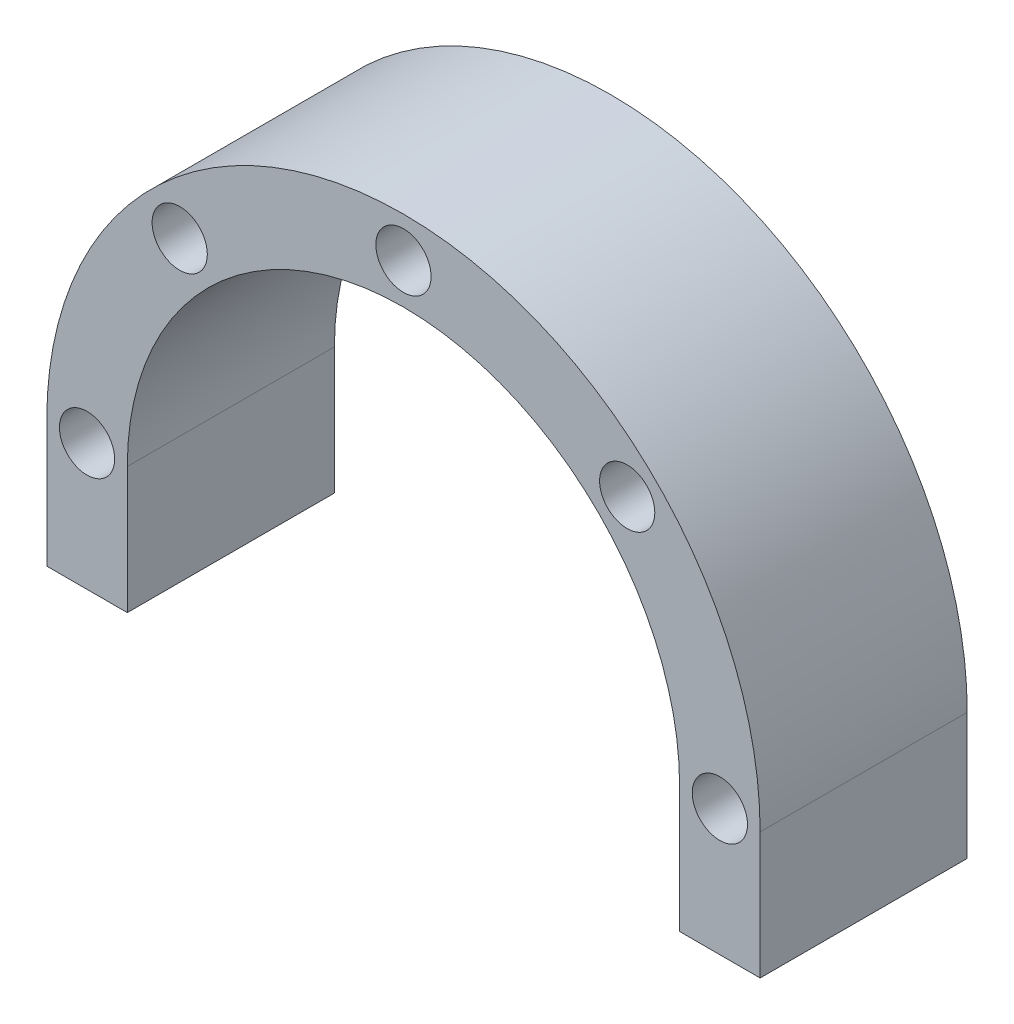
ISO-10303-21;
HEADER;
FILE_DESCRIPTION(('STEP AP214'),'2;1');
FILE_NAME('part.step','',(''),(''),'','','');
FILE_SCHEMA(('AUTOMOTIVE_DESIGN { 1 0 10303 214 1 1 1 1 }'));
ENDSEC;
DATA;
#1=APPLICATION_CONTEXT('core data for automotive mechanical design processes');
#2=APPLICATION_PROTOCOL_DEFINITION('international standard','automotive_design',2000,#1);
#3=PRODUCT_CONTEXT('',#1,'mechanical');
#4=PRODUCT('Part','Part','',(#3));
#5=PRODUCT_RELATED_PRODUCT_CATEGORY('part','',(#4));
#6=PRODUCT_DEFINITION_FORMATION('','',#4);
#7=PRODUCT_DEFINITION_CONTEXT('part definition',#1,'design');
#8=PRODUCT_DEFINITION('design','',#6,#7);
#9=PRODUCT_DEFINITION_SHAPE('','',#8);
#10=(LENGTH_UNIT() NAMED_UNIT(*) SI_UNIT(.MILLI.,.METRE.));
#11=(NAMED_UNIT(*) PLANE_ANGLE_UNIT() SI_UNIT($,.RADIAN.));
#12=(NAMED_UNIT(*) SI_UNIT($,.STERADIAN.) SOLID_ANGLE_UNIT());
#13=UNCERTAINTY_MEASURE_WITH_UNIT(LENGTH_MEASURE(1.E-05),#10,'distance_accuracy_value','');
#14=(GEOMETRIC_REPRESENTATION_CONTEXT(3) GLOBAL_UNCERTAINTY_ASSIGNED_CONTEXT((#13)) GLOBAL_UNIT_ASSIGNED_CONTEXT((#10,
#11,#12)) REPRESENTATION_CONTEXT('',''));
#15=CARTESIAN_POINT('',(0.,0.,0.));
#16=DIRECTION('',(0.,0.,1.));
#17=DIRECTION('',(1.,0.,0.));
#18=AXIS2_PLACEMENT_3D('',#15,#16,#17);
#19=CARTESIAN_POINT('',(0.,-11.,18.));
#20=DIRECTION('',(0.,1.,0.));
#21=DIRECTION('',(0.,0.,1.));
#22=AXIS2_PLACEMENT_3D('',#19,#20,#21);
#23=PLANE('',#22);
#24=DIRECTION('',(1.,0.,0.));
#25=VECTOR('',#24,1.);
#26=CARTESIAN_POINT('',(0.,-11.,0.));
#27=LINE('',#26,#25);
#28=CARTESIAN_POINT('',(-31.,-11.,0.));
#29=VERTEX_POINT('',#28);
#30=CARTESIAN_POINT('',(-24.,-11.,0.));
#31=VERTEX_POINT('',#30);
#32=EDGE_CURVE('E129',#29,#31,#27,.T.);
#33=ORIENTED_EDGE('',*,*,#32,.T.);
#34=DIRECTION('',(0.,0.,1.));
#35=VECTOR('',#34,1.);
#36=CARTESIAN_POINT('',(-24.,-11.,0.));
#37=LINE('',#36,#35);
#38=CARTESIAN_POINT('',(-24.,-11.,18.));
#39=VERTEX_POINT('',#38);
#40=EDGE_CURVE('E164',#31,#39,#37,.T.);
#41=ORIENTED_EDGE('',*,*,#40,.T.);
#42=DIRECTION('',(1.,0.,0.));
#43=VECTOR('',#42,1.);
#44=CARTESIAN_POINT('',(0.,-11.,18.));
#45=LINE('',#44,#43);
#46=CARTESIAN_POINT('',(-31.,-11.,18.));
#47=VERTEX_POINT('',#46);
#48=EDGE_CURVE('E148',#47,#39,#45,.T.);
#49=ORIENTED_EDGE('',*,*,#48,.F.);
#50=DIRECTION('',(0.,0.,-1.));
#51=VECTOR('',#50,1.);
#52=CARTESIAN_POINT('',(-31.,-11.,18.));
#53=LINE('',#52,#51);
#54=EDGE_CURVE('E43',#47,#29,#53,.T.);
#55=ORIENTED_EDGE('',*,*,#54,.T.);
#56=EDGE_LOOP('',(#33,#41,#49,#55));
#57=FACE_BOUND('',#56,.T.);
#58=ADVANCED_FACE('F35',(#57),#23,.F.);
#59=CARTESIAN_POINT('',(0.,0.,18.));
#60=DIRECTION('',(0.,0.,-1.));
#61=DIRECTION('',(-1.,0.,0.));
#62=AXIS2_PLACEMENT_3D('',#59,#60,#61);
#63=CYLINDRICAL_SURFACE('',#62,31.);
#64=CARTESIAN_POINT('',(0.,0.,0.));
#65=DIRECTION('',(0.,0.,1.));
#66=DIRECTION('',(1.,0.,0.));
#67=AXIS2_PLACEMENT_3D('',#64,#65,#66);
#68=CIRCLE('',#67,31.);
#69=CARTESIAN_POINT('',(-31.,0.,0.));
#70=VERTEX_POINT('',#69);
#71=CARTESIAN_POINT('',(31.,0.,0.));
#72=VERTEX_POINT('',#71);
#73=EDGE_CURVE('E133',#70,#72,#68,.F.);
#74=ORIENTED_EDGE('',*,*,#73,.F.);
#75=DIRECTION('',(0.,0.,-1.));
#76=VECTOR('',#75,1.);
#77=CARTESIAN_POINT('',(-31.,0.,18.));
#78=LINE('',#77,#76);
#79=CARTESIAN_POINT('',(-31.,0.,18.));
#80=VERTEX_POINT('',#79);
#81=EDGE_CURVE('E11',#80,#70,#78,.T.);
#82=ORIENTED_EDGE('',*,*,#81,.F.);
#83=CARTESIAN_POINT('',(0.,0.,18.));
#84=DIRECTION('',(0.,0.,1.));
#85=DIRECTION('',(1.,0.,0.));
#86=AXIS2_PLACEMENT_3D('',#83,#84,#85);
#87=CIRCLE('',#86,31.);
#88=CARTESIAN_POINT('',(31.,0.,18.));
#89=VERTEX_POINT('',#88);
#90=EDGE_CURVE('E138',#80,#89,#87,.F.);
#91=ORIENTED_EDGE('',*,*,#90,.T.);
#92=DIRECTION('',(0.,0.,-1.));
#93=VECTOR('',#92,1.);
#94=CARTESIAN_POINT('',(31.,0.,18.));
#95=LINE('',#94,#93);
#96=EDGE_CURVE('E79',#89,#72,#95,.T.);
#97=ORIENTED_EDGE('',*,*,#96,.T.);
#98=EDGE_LOOP('',(#74,#82,#91,#97));
#99=FACE_BOUND('',#98,.T.);
#100=ADVANCED_FACE('F37',(#99),#63,.T.);
#101=CARTESIAN_POINT('',(-31.,0.,18.));
#102=DIRECTION('',(1.,0.,0.));
#103=DIRECTION('',(0.,0.,-1.));
#104=AXIS2_PLACEMENT_3D('',#101,#102,#103);
#105=PLANE('',#104);
#106=DIRECTION('',(0.,-1.,0.));
#107=VECTOR('',#106,1.);
#108=CARTESIAN_POINT('',(-31.,0.,0.));
#109=LINE('',#108,#107);
#110=EDGE_CURVE('E130',#70,#29,#109,.T.);
#111=ORIENTED_EDGE('',*,*,#110,.T.);
#112=ORIENTED_EDGE('',*,*,#54,.F.);
#113=DIRECTION('',(0.,-1.,0.));
#114=VECTOR('',#113,1.);
#115=CARTESIAN_POINT('',(-31.,0.,18.));
#116=LINE('',#115,#114);
#117=EDGE_CURVE('E170',#80,#47,#116,.T.);
#118=ORIENTED_EDGE('',*,*,#117,.F.);
#119=ORIENTED_EDGE('',*,*,#81,.T.);
#120=EDGE_LOOP('',(#111,#112,#118,#119));
#121=FACE_BOUND('',#120,.T.);
#122=ADVANCED_FACE('F174',(#121),#105,.F.);
#123=CARTESIAN_POINT('',(24.,-11.,18.));
#124=VERTEX_POINT('',#123);
#125=CARTESIAN_POINT('',(31.,-11.,18.));
#126=VERTEX_POINT('',#125);
#127=EDGE_CURVE('E122',#124,#126,#45,.T.);
#128=ORIENTED_EDGE('',*,*,#127,.F.);
#129=DIRECTION('',(0.,0.,1.));
#130=VECTOR('',#129,1.);
#131=CARTESIAN_POINT('',(24.,-11.,0.));
#132=LINE('',#131,#130);
#133=CARTESIAN_POINT('',(24.,-11.,0.));
#134=VERTEX_POINT('',#133);
#135=EDGE_CURVE('E109',#134,#124,#132,.T.);
#136=ORIENTED_EDGE('',*,*,#135,.F.);
#137=CARTESIAN_POINT('',(31.,-11.,0.));
#138=VERTEX_POINT('',#137);
#139=EDGE_CURVE('E120',#134,#138,#27,.T.);
#140=ORIENTED_EDGE('',*,*,#139,.T.);
#141=DIRECTION('',(0.,0.,-1.));
#142=VECTOR('',#141,1.);
#143=CARTESIAN_POINT('',(31.,-11.,18.));
#144=LINE('',#143,#142);
#145=EDGE_CURVE('E140',#126,#138,#144,.T.);
#146=ORIENTED_EDGE('',*,*,#145,.F.);
#147=EDGE_LOOP('',(#128,#136,#140,#146));
#148=FACE_BOUND('',#147,.T.);
#149=ADVANCED_FACE('F118',(#148),#23,.F.);
#150=CARTESIAN_POINT('',(31.,0.,18.));
#151=DIRECTION('',(-1.,0.,0.));
#152=DIRECTION('',(0.,-1.,0.));
#153=AXIS2_PLACEMENT_3D('',#150,#151,#152);
#154=PLANE('',#153);
#155=DIRECTION('',(0.,1.,0.));
#156=VECTOR('',#155,1.);
#157=CARTESIAN_POINT('',(31.,0.,0.));
#158=LINE('',#157,#156);
#159=EDGE_CURVE('E128',#138,#72,#158,.T.);
#160=ORIENTED_EDGE('',*,*,#159,.T.);
#161=ORIENTED_EDGE('',*,*,#96,.F.);
#162=DIRECTION('',(0.,1.,0.));
#163=VECTOR('',#162,1.);
#164=CARTESIAN_POINT('',(31.,0.,18.));
#165=LINE('',#164,#163);
#166=EDGE_CURVE('E59',#126,#89,#165,.T.);
#167=ORIENTED_EDGE('',*,*,#166,.F.);
#168=ORIENTED_EDGE('',*,*,#145,.T.);
#169=EDGE_LOOP('',(#160,#161,#167,#168));
#170=FACE_BOUND('',#169,.T.);
#171=ADVANCED_FACE('F184',(#170),#154,.F.);
#172=CARTESIAN_POINT('',(0.,0.,18.));
#173=DIRECTION('',(0.,0.,1.));
#174=DIRECTION('',(1.,0.,0.));
#175=AXIS2_PLACEMENT_3D('',#172,#173,#174);
#176=PLANE('',#175);
#177=CARTESIAN_POINT('',(-19.4454364826298,19.4454364826303,18.));
#178=DIRECTION('',(0.,0.,1.));
#179=DIRECTION('',(1.,0.,0.));
#180=AXIS2_PLACEMENT_3D('',#177,#178,#179);
#181=CIRCLE('',#180,2.4);
#182=CARTESIAN_POINT('',(-17.0454364826298,19.4454364826303,18.));
#183=VERTEX_POINT('',#182);
#184=EDGE_CURVE('E234',#183,#183,#181,.T.);
#185=ORIENTED_EDGE('',*,*,#184,.F.);
#186=EDGE_LOOP('',(#185));
#187=FACE_BOUND('',#186,.T.);
#188=CARTESIAN_POINT('',(-27.5,2.88047210454558E-13,18.));
#189=DIRECTION('',(0.,0.,1.));
#190=DIRECTION('',(1.,0.,0.));
#191=AXIS2_PLACEMENT_3D('',#188,#189,#190);
#192=CIRCLE('',#191,2.4);
#193=CARTESIAN_POINT('',(-25.1,2.88047210454558E-13,18.));
#194=VERTEX_POINT('',#193);
#195=EDGE_CURVE('E236',#194,#194,#192,.T.);
#196=ORIENTED_EDGE('',*,*,#195,.F.);
#197=EDGE_LOOP('',(#196));
#198=FACE_BOUND('',#197,.T.);
#199=CARTESIAN_POINT('',(27.5,0.,18.));
#200=DIRECTION('',(0.,0.,1.));
#201=DIRECTION('',(1.,0.,0.));
#202=AXIS2_PLACEMENT_3D('',#199,#200,#201);
#203=CIRCLE('',#202,2.4);
#204=CARTESIAN_POINT('',(29.9,0.,18.));
#205=VERTEX_POINT('',#204);
#206=EDGE_CURVE('E244',#205,#205,#203,.T.);
#207=ORIENTED_EDGE('',*,*,#206,.F.);
#208=EDGE_LOOP('',(#207));
#209=FACE_BOUND('',#208,.T.);
#210=CARTESIAN_POINT('',(19.4454364826301,19.44543648263,18.));
#211=DIRECTION('',(0.,0.,1.));
#212=DIRECTION('',(1.,0.,0.));
#213=AXIS2_PLACEMENT_3D('',#210,#211,#212);
#214=CIRCLE('',#213,2.4);
#215=CARTESIAN_POINT('',(21.8454364826301,19.44543648263,18.));
#216=VERTEX_POINT('',#215);
#217=EDGE_CURVE('E250',#216,#216,#214,.T.);
#218=ORIENTED_EDGE('',*,*,#217,.F.);
#219=EDGE_LOOP('',(#218));
#220=FACE_BOUND('',#219,.T.);
#221=CARTESIAN_POINT('',(0.,27.5,18.));
#222=DIRECTION('',(0.,0.,1.));
#223=DIRECTION('',(1.,0.,0.));
#224=AXIS2_PLACEMENT_3D('',#221,#222,#223);
#225=CIRCLE('',#224,2.4);
#226=CARTESIAN_POINT('',(2.4,27.5,18.));
#227=VERTEX_POINT('',#226);
#228=EDGE_CURVE('E256',#227,#227,#225,.T.);
#229=ORIENTED_EDGE('',*,*,#228,.F.);
#230=EDGE_LOOP('',(#229));
#231=FACE_BOUND('',#230,.T.);
#232=DIRECTION('',(0.,-1.,0.));
#233=VECTOR('',#232,1.);
#234=CARTESIAN_POINT('',(-24.,0.,18.));
#235=LINE('',#234,#233);
#236=CARTESIAN_POINT('',(-24.,0.,18.));
#237=VERTEX_POINT('',#236);
#238=EDGE_CURVE('E114',#237,#39,#235,.T.);
#239=ORIENTED_EDGE('',*,*,#238,.F.);
#240=CARTESIAN_POINT('',(0.,0.,18.));
#241=DIRECTION('',(0.,0.,1.));
#242=DIRECTION('',(1.,0.,0.));
#243=AXIS2_PLACEMENT_3D('',#240,#241,#242);
#244=CIRCLE('',#243,24.);
#245=CARTESIAN_POINT('',(24.,0.,18.));
#246=VERTEX_POINT('',#245);
#247=EDGE_CURVE('E159',#246,#237,#244,.T.);
#248=ORIENTED_EDGE('',*,*,#247,.F.);
#249=DIRECTION('',(0.,1.,0.));
#250=VECTOR('',#249,1.);
#251=CARTESIAN_POINT('',(24.,-11.,18.));
#252=LINE('',#251,#250);
#253=EDGE_CURVE('E157',#124,#246,#252,.T.);
#254=ORIENTED_EDGE('',*,*,#253,.F.);
#255=ORIENTED_EDGE('',*,*,#127,.T.);
#256=ORIENTED_EDGE('',*,*,#166,.T.);
#257=ORIENTED_EDGE('',*,*,#90,.F.);
#258=ORIENTED_EDGE('',*,*,#117,.T.);
#259=ORIENTED_EDGE('',*,*,#48,.T.);
#260=EDGE_LOOP('',(#239,#248,#254,#255,#256,#257,#258,#259));
#261=FACE_BOUND('',#260,.T.);
#262=ADVANCED_FACE('F188',(#187,#198,#209,#220,#231,#261),#176,.T.);
#263=CARTESIAN_POINT('',(0.,0.,0.));
#264=DIRECTION('',(0.,0.,1.));
#265=DIRECTION('',(1.,0.,0.));
#266=AXIS2_PLACEMENT_3D('',#263,#264,#265);
#267=PLANE('',#266);
#268=CARTESIAN_POINT('',(-19.4454364826298,19.4454364826303,0.));
#269=DIRECTION('',(0.,0.,1.));
#270=DIRECTION('',(1.,0.,0.));
#271=AXIS2_PLACEMENT_3D('',#268,#269,#270);
#272=CIRCLE('',#271,2.4);
#273=CARTESIAN_POINT('',(-17.0454364826298,19.4454364826303,0.));
#274=VERTEX_POINT('',#273);
#275=EDGE_CURVE('E231',#274,#274,#272,.T.);
#276=ORIENTED_EDGE('',*,*,#275,.T.);
#277=EDGE_LOOP('',(#276));
#278=FACE_BOUND('',#277,.T.);
#279=CARTESIAN_POINT('',(-27.5,2.88047210454558E-13,0.));
#280=DIRECTION('',(0.,0.,1.));
#281=DIRECTION('',(1.,0.,0.));
#282=AXIS2_PLACEMENT_3D('',#279,#280,#281);
#283=CIRCLE('',#282,2.4);
#284=CARTESIAN_POINT('',(-25.1,2.88047210454558E-13,0.));
#285=VERTEX_POINT('',#284);
#286=EDGE_CURVE('E241',#285,#285,#283,.T.);
#287=ORIENTED_EDGE('',*,*,#286,.T.);
#288=EDGE_LOOP('',(#287));
#289=FACE_BOUND('',#288,.T.);
#290=CARTESIAN_POINT('',(27.5,0.,0.));
#291=DIRECTION('',(0.,0.,1.));
#292=DIRECTION('',(1.,0.,0.));
#293=AXIS2_PLACEMENT_3D('',#290,#291,#292);
#294=CIRCLE('',#293,2.4);
#295=CARTESIAN_POINT('',(29.9,0.,0.));
#296=VERTEX_POINT('',#295);
#297=EDGE_CURVE('E247',#296,#296,#294,.T.);
#298=ORIENTED_EDGE('',*,*,#297,.T.);
#299=EDGE_LOOP('',(#298));
#300=FACE_BOUND('',#299,.T.);
#301=CARTESIAN_POINT('',(19.4454364826301,19.44543648263,0.));
#302=DIRECTION('',(0.,0.,1.));
#303=DIRECTION('',(1.,0.,0.));
#304=AXIS2_PLACEMENT_3D('',#301,#302,#303);
#305=CIRCLE('',#304,2.4);
#306=CARTESIAN_POINT('',(21.8454364826301,19.44543648263,0.));
#307=VERTEX_POINT('',#306);
#308=EDGE_CURVE('E253',#307,#307,#305,.T.);
#309=ORIENTED_EDGE('',*,*,#308,.T.);
#310=EDGE_LOOP('',(#309));
#311=FACE_BOUND('',#310,.T.);
#312=CARTESIAN_POINT('',(0.,27.5,0.));
#313=DIRECTION('',(0.,0.,1.));
#314=DIRECTION('',(1.,0.,0.));
#315=AXIS2_PLACEMENT_3D('',#312,#313,#314);
#316=CIRCLE('',#315,2.4);
#317=CARTESIAN_POINT('',(2.4,27.5,0.));
#318=VERTEX_POINT('',#317);
#319=EDGE_CURVE('E160',#318,#318,#316,.T.);
#320=ORIENTED_EDGE('',*,*,#319,.T.);
#321=EDGE_LOOP('',(#320));
#322=FACE_BOUND('',#321,.T.);
#323=CARTESIAN_POINT('',(0.,0.,0.));
#324=DIRECTION('',(0.,0.,1.));
#325=DIRECTION('',(1.,0.,0.));
#326=AXIS2_PLACEMENT_3D('',#323,#324,#325);
#327=CIRCLE('',#326,24.);
#328=CARTESIAN_POINT('',(24.,0.,0.));
#329=VERTEX_POINT('',#328);
#330=CARTESIAN_POINT('',(-24.,0.,0.));
#331=VERTEX_POINT('',#330);
#332=EDGE_CURVE('E50',#329,#331,#327,.T.);
#333=ORIENTED_EDGE('',*,*,#332,.T.);
#334=DIRECTION('',(0.,-1.,0.));
#335=VECTOR('',#334,1.);
#336=CARTESIAN_POINT('',(-24.,0.,0.));
#337=LINE('',#336,#335);
#338=EDGE_CURVE('E123',#331,#31,#337,.T.);
#339=ORIENTED_EDGE('',*,*,#338,.T.);
#340=ORIENTED_EDGE('',*,*,#32,.F.);
#341=ORIENTED_EDGE('',*,*,#110,.F.);
#342=ORIENTED_EDGE('',*,*,#73,.T.);
#343=ORIENTED_EDGE('',*,*,#159,.F.);
#344=ORIENTED_EDGE('',*,*,#139,.F.);
#345=DIRECTION('',(0.,1.,0.));
#346=VECTOR('',#345,1.);
#347=CARTESIAN_POINT('',(24.,-11.,0.));
#348=LINE('',#347,#346);
#349=EDGE_CURVE('E105',#134,#329,#348,.T.);
#350=ORIENTED_EDGE('',*,*,#349,.T.);
#351=EDGE_LOOP('',(#333,#339,#340,#341,#342,#343,#344,#350));
#352=FACE_BOUND('',#351,.T.);
#353=ADVANCED_FACE('F126',(#278,#289,#300,#311,#322,#352),#267,.F.);
#354=CARTESIAN_POINT('',(-24.,0.,0.));
#355=DIRECTION('',(-1.,0.,0.));
#356=DIRECTION('',(0.,0.,1.));
#357=AXIS2_PLACEMENT_3D('',#354,#355,#356);
#358=PLANE('',#357);
#359=ORIENTED_EDGE('',*,*,#238,.T.);
#360=ORIENTED_EDGE('',*,*,#40,.F.);
#361=ORIENTED_EDGE('',*,*,#338,.F.);
#362=DIRECTION('',(0.,0.,1.));
#363=VECTOR('',#362,1.);
#364=CARTESIAN_POINT('',(-24.,0.,0.));
#365=LINE('',#364,#363);
#366=EDGE_CURVE('E166',#331,#237,#365,.T.);
#367=ORIENTED_EDGE('',*,*,#366,.T.);
#368=EDGE_LOOP('',(#359,#360,#361,#367));
#369=FACE_BOUND('',#368,.T.);
#370=ADVANCED_FACE('F197',(#369),#358,.F.);
#371=CARTESIAN_POINT('',(0.,0.,0.));
#372=DIRECTION('',(0.,0.,1.));
#373=DIRECTION('',(1.,0.,0.));
#374=AXIS2_PLACEMENT_3D('',#371,#372,#373);
#375=CYLINDRICAL_SURFACE('',#374,24.);
#376=ORIENTED_EDGE('',*,*,#247,.T.);
#377=ORIENTED_EDGE('',*,*,#366,.F.);
#378=ORIENTED_EDGE('',*,*,#332,.F.);
#379=DIRECTION('',(0.,0.,1.));
#380=VECTOR('',#379,1.);
#381=CARTESIAN_POINT('',(24.,0.,0.));
#382=LINE('',#381,#380);
#383=EDGE_CURVE('E111',#329,#246,#382,.T.);
#384=ORIENTED_EDGE('',*,*,#383,.T.);
#385=EDGE_LOOP('',(#376,#377,#378,#384));
#386=FACE_BOUND('',#385,.T.);
#387=ADVANCED_FACE('F203',(#386),#375,.F.);
#388=CARTESIAN_POINT('',(24.,-11.,0.));
#389=DIRECTION('',(1.,0.,0.));
#390=DIRECTION('',(0.,0.,-1.));
#391=AXIS2_PLACEMENT_3D('',#388,#389,#390);
#392=PLANE('',#391);
#393=ORIENTED_EDGE('',*,*,#253,.T.);
#394=ORIENTED_EDGE('',*,*,#383,.F.);
#395=ORIENTED_EDGE('',*,*,#349,.F.);
#396=ORIENTED_EDGE('',*,*,#135,.T.);
#397=EDGE_LOOP('',(#393,#394,#395,#396));
#398=FACE_BOUND('',#397,.T.);
#399=ADVANCED_FACE('F108',(#398),#392,.F.);
#400=CARTESIAN_POINT('',(0.,27.5,18.));
#401=DIRECTION('',(0.,0.,1.));
#402=DIRECTION('',(1.,0.,0.));
#403=AXIS2_PLACEMENT_3D('',#400,#401,#402);
#404=CYLINDRICAL_SURFACE('',#403,2.4);
#405=ORIENTED_EDGE('',*,*,#319,.F.);
#406=EDGE_LOOP('',(#405));
#407=FACE_BOUND('',#406,.T.);
#408=ORIENTED_EDGE('',*,*,#228,.T.);
#409=EDGE_LOOP('',(#408));
#410=FACE_BOUND('',#409,.T.);
#411=ADVANCED_FACE('F202',(#407,#410),#404,.F.);
#412=CARTESIAN_POINT('',(19.4454364826301,19.44543648263,18.));
#413=DIRECTION('',(0.,0.,1.));
#414=DIRECTION('',(1.,0.,0.));
#415=AXIS2_PLACEMENT_3D('',#412,#413,#414);
#416=CYLINDRICAL_SURFACE('',#415,2.4);
#417=ORIENTED_EDGE('',*,*,#308,.F.);
#418=EDGE_LOOP('',(#417));
#419=FACE_BOUND('',#418,.T.);
#420=ORIENTED_EDGE('',*,*,#217,.T.);
#421=EDGE_LOOP('',(#420));
#422=FACE_BOUND('',#421,.T.);
#423=ADVANCED_FACE('F210',(#419,#422),#416,.F.);
#424=CARTESIAN_POINT('',(27.5,0.,18.));
#425=DIRECTION('',(0.,0.,1.));
#426=DIRECTION('',(1.,0.,0.));
#427=AXIS2_PLACEMENT_3D('',#424,#425,#426);
#428=CYLINDRICAL_SURFACE('',#427,2.4);
#429=ORIENTED_EDGE('',*,*,#297,.F.);
#430=EDGE_LOOP('',(#429));
#431=FACE_BOUND('',#430,.T.);
#432=ORIENTED_EDGE('',*,*,#206,.T.);
#433=EDGE_LOOP('',(#432));
#434=FACE_BOUND('',#433,.T.);
#435=ADVANCED_FACE('F214',(#431,#434),#428,.F.);
#436=CARTESIAN_POINT('',(-27.5,2.88047210454558E-13,18.));
#437=DIRECTION('',(0.,0.,1.));
#438=DIRECTION('',(1.,0.,0.));
#439=AXIS2_PLACEMENT_3D('',#436,#437,#438);
#440=CYLINDRICAL_SURFACE('',#439,2.4);
#441=ORIENTED_EDGE('',*,*,#286,.F.);
#442=EDGE_LOOP('',(#441));
#443=FACE_BOUND('',#442,.T.);
#444=ORIENTED_EDGE('',*,*,#195,.T.);
#445=EDGE_LOOP('',(#444));
#446=FACE_BOUND('',#445,.T.);
#447=ADVANCED_FACE('F218',(#443,#446),#440,.F.);
#448=CARTESIAN_POINT('',(-19.4454364826298,19.4454364826303,18.));
#449=DIRECTION('',(0.,0.,1.));
#450=DIRECTION('',(1.,0.,0.));
#451=AXIS2_PLACEMENT_3D('',#448,#449,#450);
#452=CYLINDRICAL_SURFACE('',#451,2.4);
#453=ORIENTED_EDGE('',*,*,#275,.F.);
#454=EDGE_LOOP('',(#453));
#455=FACE_BOUND('',#454,.T.);
#456=ORIENTED_EDGE('',*,*,#184,.T.);
#457=EDGE_LOOP('',(#456));
#458=FACE_BOUND('',#457,.T.);
#459=ADVANCED_FACE('F222',(#455,#458),#452,.F.);
#460=CLOSED_SHELL('',(#58,#100,#122,#149,#171,#262,#353,#370,#387,#399,#411,#423,#435,#447,#459));
#461=MANIFOLD_SOLID_BREP('B2',#460);
#462=ADVANCED_BREP_SHAPE_REPRESENTATION('',(#18,#461),#14);
#463=SHAPE_DEFINITION_REPRESENTATION(#9,#462);
ENDSEC;
END-ISO-10303-21;
